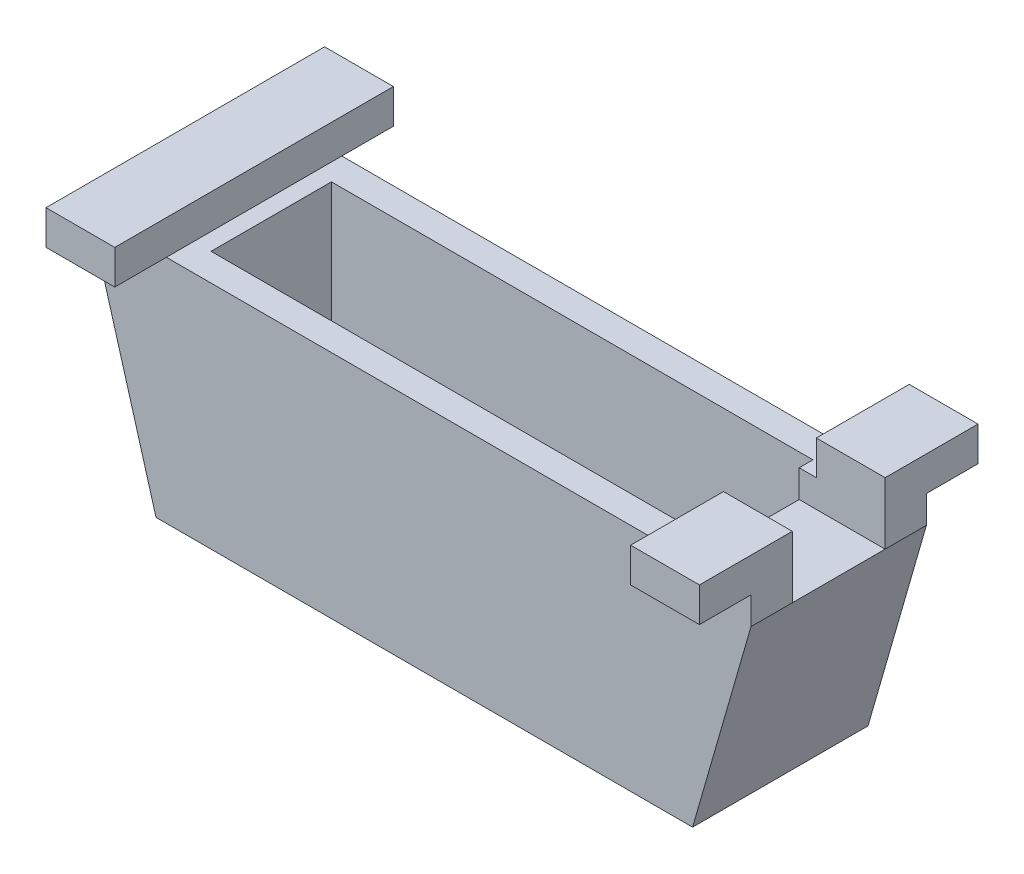
ISO-10303-21;
HEADER;
FILE_DESCRIPTION(('STEP AP214'),'2;1');
FILE_NAME('part.step','',(''),(''),'','','');
FILE_SCHEMA(('AUTOMOTIVE_DESIGN { 1 0 10303 214 1 1 1 1 }'));
ENDSEC;
DATA;
#1=APPLICATION_CONTEXT('core data for automotive mechanical design processes');
#2=APPLICATION_PROTOCOL_DEFINITION('international standard','automotive_design',2000,#1);
#3=PRODUCT_CONTEXT('',#1,'mechanical');
#4=PRODUCT('Part','Part','',(#3));
#5=PRODUCT_RELATED_PRODUCT_CATEGORY('part','',(#4));
#6=PRODUCT_DEFINITION_FORMATION('','',#4);
#7=PRODUCT_DEFINITION_CONTEXT('part definition',#1,'design');
#8=PRODUCT_DEFINITION('design','',#6,#7);
#9=PRODUCT_DEFINITION_SHAPE('','',#8);
#10=(LENGTH_UNIT() NAMED_UNIT(*) SI_UNIT(.MILLI.,.METRE.));
#11=(NAMED_UNIT(*) PLANE_ANGLE_UNIT() SI_UNIT($,.RADIAN.));
#12=(NAMED_UNIT(*) SI_UNIT($,.STERADIAN.) SOLID_ANGLE_UNIT());
#13=UNCERTAINTY_MEASURE_WITH_UNIT(LENGTH_MEASURE(1.E-05),#10,'distance_accuracy_value','');
#14=(GEOMETRIC_REPRESENTATION_CONTEXT(3) GLOBAL_UNCERTAINTY_ASSIGNED_CONTEXT((#13)) GLOBAL_UNIT_ASSIGNED_CONTEXT((#10,
#11,#12)) REPRESENTATION_CONTEXT('',''));
#15=CARTESIAN_POINT('',(0.,0.,0.));
#16=DIRECTION('',(0.,0.,1.));
#17=DIRECTION('',(1.,0.,0.));
#18=AXIS2_PLACEMENT_3D('',#15,#16,#17);
#19=CARTESIAN_POINT('',(60.317753860768,42.545,-16.1925));
#20=DIRECTION('',(-1.,0.,0.));
#21=DIRECTION('',(0.,0.,1.));
#22=AXIS2_PLACEMENT_3D('',#19,#20,#21);
#23=PLANE('',#22);
#24=DIRECTION('',(0.,0.,-1.));
#25=VECTOR('',#24,1.);
#26=CARTESIAN_POINT('',(60.317753860768,48.895,-25.7175));
#27=LINE('',#26,#25);
#28=CARTESIAN_POINT('',(60.317753860768,48.895,-8.5725));
#29=VERTEX_POINT('',#28);
#30=CARTESIAN_POINT('',(60.317753860768,48.895,-25.7175));
#31=VERTEX_POINT('',#30);
#32=EDGE_CURVE('E299',#29,#31,#27,.T.);
#33=ORIENTED_EDGE('',*,*,#32,.F.);
#34=DIRECTION('',(0.,1.,0.));
#35=VECTOR('',#34,1.);
#36=CARTESIAN_POINT('',(60.317753860768,37.465,-8.5725));
#37=LINE('',#36,#35);
#38=CARTESIAN_POINT('',(60.317753860768,37.465,-8.5725));
#39=VERTEX_POINT('',#38);
#40=EDGE_CURVE('E231',#39,#29,#37,.T.);
#41=ORIENTED_EDGE('',*,*,#40,.F.);
#42=DIRECTION('',(0.,0.,-1.));
#43=VECTOR('',#42,1.);
#44=CARTESIAN_POINT('',(60.317753860768,37.465,-16.1925));
#45=LINE('',#44,#43);
#46=CARTESIAN_POINT('',(60.317753860768,37.465,-16.1925));
#47=VERTEX_POINT('',#46);
#48=EDGE_CURVE('E342',#39,#47,#45,.T.);
#49=ORIENTED_EDGE('',*,*,#48,.T.);
#50=DIRECTION('',(0.,-1.,0.));
#51=VECTOR('',#50,1.);
#52=CARTESIAN_POINT('',(60.317753860768,42.545,-16.1925));
#53=LINE('',#52,#51);
#54=CARTESIAN_POINT('',(60.317753860768,42.545,-16.1925));
#55=VERTEX_POINT('',#54);
#56=EDGE_CURVE('E365',#55,#47,#53,.T.);
#57=ORIENTED_EDGE('',*,*,#56,.F.);
#58=DIRECTION('',(0.,0.,-1.));
#59=VECTOR('',#58,1.);
#60=CARTESIAN_POINT('',(60.317753860768,42.545,-25.7175));
#61=LINE('',#60,#59);
#62=CARTESIAN_POINT('',(60.317753860768,42.545,-25.7175));
#63=VERTEX_POINT('',#62);
#64=EDGE_CURVE('E294',#55,#63,#61,.T.);
#65=ORIENTED_EDGE('',*,*,#64,.T.);
#66=DIRECTION('',(0.,-1.,0.));
#67=VECTOR('',#66,1.);
#68=CARTESIAN_POINT('',(60.317753860768,48.895,-25.7175));
#69=LINE('',#68,#67);
#70=EDGE_CURVE('E328',#31,#63,#69,.T.);
#71=ORIENTED_EDGE('',*,*,#70,.F.);
#72=EDGE_LOOP('',(#33,#41,#49,#57,#65,#71));
#73=FACE_BOUND('',#72,.T.);
#74=ADVANCED_FACE('F35',(#73),#23,.F.);
#75=CARTESIAN_POINT('',(47.617753860768,48.895,-25.7175));
#76=DIRECTION('',(1.,0.,0.));
#77=DIRECTION('',(0.,0.,-1.));
#78=AXIS2_PLACEMENT_3D('',#75,#76,#77);
#79=PLANE('',#78);
#80=DIRECTION('',(0.,0.,1.));
#81=VECTOR('',#80,1.);
#82=CARTESIAN_POINT('',(47.617753860768,42.545,-25.7175));
#83=LINE('',#82,#81);
#84=CARTESIAN_POINT('',(47.617753860768,42.545,-16.1925));
#85=VERTEX_POINT('',#84);
#86=CARTESIAN_POINT('',(47.617753860768,42.545,-8.57249999999999));
#87=VERTEX_POINT('',#86);
#88=EDGE_CURVE('E43',#85,#87,#83,.T.);
#89=ORIENTED_EDGE('',*,*,#88,.T.);
#90=DIRECTION('',(0.,1.,0.));
#91=VECTOR('',#90,1.);
#92=CARTESIAN_POINT('',(47.617753860768,48.895,-8.57249999999999));
#93=LINE('',#92,#91);
#94=CARTESIAN_POINT('',(47.617753860768,48.895,-8.57249999999999));
#95=VERTEX_POINT('',#94);
#96=EDGE_CURVE('E242',#87,#95,#93,.T.);
#97=ORIENTED_EDGE('',*,*,#96,.T.);
#98=DIRECTION('',(0.,0.,1.));
#99=VECTOR('',#98,1.);
#100=CARTESIAN_POINT('',(47.617753860768,48.895,-25.7175));
#101=LINE('',#100,#99);
#102=CARTESIAN_POINT('',(47.617753860768,48.895,-25.7175));
#103=VERTEX_POINT('',#102);
#104=EDGE_CURVE('E302',#103,#95,#101,.T.);
#105=ORIENTED_EDGE('',*,*,#104,.F.);
#106=DIRECTION('',(0.,-1.,0.));
#107=VECTOR('',#106,1.);
#108=CARTESIAN_POINT('',(47.617753860768,48.895,-25.7175));
#109=LINE('',#108,#107);
#110=CARTESIAN_POINT('',(47.617753860768,42.545,-25.7175));
#111=VERTEX_POINT('',#110);
#112=EDGE_CURVE('E325',#103,#111,#109,.T.);
#113=ORIENTED_EDGE('',*,*,#112,.T.);
#114=EDGE_CURVE('E314',#111,#85,#83,.T.);
#115=ORIENTED_EDGE('',*,*,#114,.T.);
#116=EDGE_LOOP('',(#89,#97,#105,#113,#115));
#117=FACE_BOUND('',#116,.T.);
#118=ADVANCED_FACE('F459',(#117),#79,.F.);
#119=CARTESIAN_POINT('',(0.,48.895,0.));
#120=DIRECTION('',(0.,-1.,0.));
#121=DIRECTION('',(0.,0.,-1.));
#122=AXIS2_PLACEMENT_3D('',#119,#120,#121);
#123=PLANE('',#122);
#124=ORIENTED_EDGE('',*,*,#104,.T.);
#125=DIRECTION('',(-1.,0.,0.));
#126=VECTOR('',#125,1.);
#127=CARTESIAN_POINT('',(44.45,48.895,-8.57249999999999));
#128=LINE('',#127,#126);
#129=EDGE_CURVE('E224',#29,#95,#128,.T.);
#130=ORIENTED_EDGE('',*,*,#129,.F.);
#131=ORIENTED_EDGE('',*,*,#32,.T.);
#132=DIRECTION('',(-1.,0.,0.));
#133=VECTOR('',#132,1.);
#134=CARTESIAN_POINT('',(60.317753860768,48.895,-25.7175));
#135=LINE('',#134,#133);
#136=EDGE_CURVE('E298',#31,#103,#135,.T.);
#137=ORIENTED_EDGE('',*,*,#136,.T.);
#138=EDGE_LOOP('',(#124,#130,#131,#137));
#139=FACE_BOUND('',#138,.T.);
#140=ADVANCED_FACE('F447',(#139),#123,.F.);
#141=CARTESIAN_POINT('',(0.,42.545,0.));
#142=DIRECTION('',(0.,1.,0.));
#143=DIRECTION('',(0.,0.,1.));
#144=AXIS2_PLACEMENT_3D('',#141,#142,#143);
#145=PLANE('',#144);
#146=DIRECTION('',(-1.,0.,0.));
#147=VECTOR('',#146,1.);
#148=CARTESIAN_POINT('',(0.,42.545,-8.57249999999997));
#149=LINE('',#148,#147);
#150=CARTESIAN_POINT('',(44.45,42.545,-8.57249999999999));
#151=VERTEX_POINT('',#150);
#152=EDGE_CURVE('E245',#87,#151,#149,.T.);
#153=ORIENTED_EDGE('',*,*,#152,.F.);
#154=ORIENTED_EDGE('',*,*,#88,.F.);
#155=DIRECTION('',(-1.,0.,0.));
#156=VECTOR('',#155,1.);
#157=CARTESIAN_POINT('',(-60.317753860768,42.545,-16.1925));
#158=LINE('',#157,#156);
#159=CARTESIAN_POINT('',(-47.617753860768,42.545,-16.1925));
#160=VERTEX_POINT('',#159);
#161=EDGE_CURVE('E347',#85,#160,#158,.T.);
#162=ORIENTED_EDGE('',*,*,#161,.T.);
#163=DIRECTION('',(0.,0.,-1.));
#164=VECTOR('',#163,1.);
#165=CARTESIAN_POINT('',(-47.617753860768,42.545,-25.7175));
#166=LINE('',#165,#164);
#167=CARTESIAN_POINT('',(-47.617753860768,42.545,16.1925));
#168=VERTEX_POINT('',#167);
#169=EDGE_CURVE('E281',#168,#160,#166,.T.);
#170=ORIENTED_EDGE('',*,*,#169,.F.);
#171=DIRECTION('',(1.,0.,0.));
#172=VECTOR('',#171,1.);
#173=CARTESIAN_POINT('',(-60.317753860768,42.545,16.1925));
#174=LINE('',#173,#172);
#175=CARTESIAN_POINT('',(47.617753860768,42.545,16.1925));
#176=VERTEX_POINT('',#175);
#177=EDGE_CURVE('E352',#168,#176,#174,.T.);
#178=ORIENTED_EDGE('',*,*,#177,.T.);
#179=CARTESIAN_POINT('',(47.617753860768,42.545,8.5725));
#180=VERTEX_POINT('',#179);
#181=EDGE_CURVE('E318',#180,#176,#83,.T.);
#182=ORIENTED_EDGE('',*,*,#181,.F.);
#183=DIRECTION('',(1.,0.,0.));
#184=VECTOR('',#183,1.);
#185=CARTESIAN_POINT('',(0.,42.545,8.5725));
#186=LINE('',#185,#184);
#187=CARTESIAN_POINT('',(44.45,42.545,8.5725));
#188=VERTEX_POINT('',#187);
#189=EDGE_CURVE('E239',#188,#180,#186,.T.);
#190=ORIENTED_EDGE('',*,*,#189,.F.);
#191=DIRECTION('',(0.,0.,-1.));
#192=VECTOR('',#191,1.);
#193=CARTESIAN_POINT('',(44.45,42.545,-11.1125));
#194=LINE('',#193,#192);
#195=CARTESIAN_POINT('',(44.45,42.545,11.1125));
#196=VERTEX_POINT('',#195);
#197=EDGE_CURVE('E229',#196,#188,#194,.T.);
#198=ORIENTED_EDGE('',*,*,#197,.F.);
#199=DIRECTION('',(1.,0.,0.));
#200=VECTOR('',#199,1.);
#201=CARTESIAN_POINT('',(-44.45,42.545,11.1125));
#202=LINE('',#201,#200);
#203=CARTESIAN_POINT('',(-44.45,42.545,11.1125));
#204=VERTEX_POINT('',#203);
#205=EDGE_CURVE('E339',#204,#196,#202,.T.);
#206=ORIENTED_EDGE('',*,*,#205,.F.);
#207=DIRECTION('',(0.,0.,1.));
#208=VECTOR('',#207,1.);
#209=CARTESIAN_POINT('',(-44.45,42.545,-11.1125));
#210=LINE('',#209,#208);
#211=CARTESIAN_POINT('',(-44.45,42.545,-11.1125));
#212=VERTEX_POINT('',#211);
#213=EDGE_CURVE('E336',#212,#204,#210,.T.);
#214=ORIENTED_EDGE('',*,*,#213,.F.);
#215=DIRECTION('',(-1.,0.,0.));
#216=VECTOR('',#215,1.);
#217=CARTESIAN_POINT('',(-44.45,42.545,-11.1125));
#218=LINE('',#217,#216);
#219=CARTESIAN_POINT('',(44.45,42.545,-11.1125));
#220=VERTEX_POINT('',#219);
#221=EDGE_CURVE('E333',#220,#212,#218,.T.);
#222=ORIENTED_EDGE('',*,*,#221,.F.);
#223=EDGE_CURVE('E331',#151,#220,#194,.T.);
#224=ORIENTED_EDGE('',*,*,#223,.F.);
#225=EDGE_LOOP('',(#153,#154,#162,#170,#178,#182,#190,#198,#206,#214,#222,#224));
#226=FACE_BOUND('',#225,.T.);
#227=ADVANCED_FACE('F424',(#226),#145,.T.);
#228=CARTESIAN_POINT('',(0.,2.54,0.));
#229=DIRECTION('',(0.,-1.,0.));
#230=DIRECTION('',(0.,0.,-1.));
#231=AXIS2_PLACEMENT_3D('',#228,#229,#230);
#232=PLANE('',#231);
#233=DIRECTION('',(0.,0.,-1.));
#234=VECTOR('',#233,1.);
#235=CARTESIAN_POINT('',(44.45,2.54,11.1125));
#236=LINE('',#235,#234);
#237=CARTESIAN_POINT('',(44.45,2.54,11.1125));
#238=VERTEX_POINT('',#237);
#239=CARTESIAN_POINT('',(44.45,2.54,-11.1125));
#240=VERTEX_POINT('',#239);
#241=EDGE_CURVE('E388',#238,#240,#236,.T.);
#242=ORIENTED_EDGE('',*,*,#241,.T.);
#243=DIRECTION('',(-1.,0.,0.));
#244=VECTOR('',#243,1.);
#245=CARTESIAN_POINT('',(-44.45,2.54,-11.1125));
#246=LINE('',#245,#244);
#247=CARTESIAN_POINT('',(-44.45,2.54,-11.1125));
#248=VERTEX_POINT('',#247);
#249=EDGE_CURVE('E391',#240,#248,#246,.T.);
#250=ORIENTED_EDGE('',*,*,#249,.T.);
#251=DIRECTION('',(0.,0.,1.));
#252=VECTOR('',#251,1.);
#253=CARTESIAN_POINT('',(-44.45,2.54,11.1125));
#254=LINE('',#253,#252);
#255=CARTESIAN_POINT('',(-44.45,2.54,11.1125));
#256=VERTEX_POINT('',#255);
#257=EDGE_CURVE('E394',#248,#256,#254,.T.);
#258=ORIENTED_EDGE('',*,*,#257,.T.);
#259=DIRECTION('',(1.,0.,0.));
#260=VECTOR('',#259,1.);
#261=CARTESIAN_POINT('',(-44.45,2.54,11.1125));
#262=LINE('',#261,#260);
#263=EDGE_CURVE('E396',#256,#238,#262,.T.);
#264=ORIENTED_EDGE('',*,*,#263,.T.);
#265=EDGE_LOOP('',(#242,#250,#258,#264));
#266=FACE_BOUND('',#265,.T.);
#267=ADVANCED_FACE('F468',(#266),#232,.F.);
#268=CARTESIAN_POINT('',(-44.45,-104.219344773415,11.1125));
#269=DIRECTION('',(-1.,0.,0.));
#270=DIRECTION('',(0.,0.,1.));
#271=AXIS2_PLACEMENT_3D('',#268,#269,#270);
#272=PLANE('',#271);
#273=DIRECTION('',(0.,1.,0.));
#274=VECTOR('',#273,1.);
#275=CARTESIAN_POINT('',(-44.45,-104.219344773415,11.1125));
#276=LINE('',#275,#274);
#277=EDGE_CURVE('E386',#256,#204,#276,.T.);
#278=ORIENTED_EDGE('',*,*,#277,.F.);
#279=ORIENTED_EDGE('',*,*,#257,.F.);
#280=DIRECTION('',(0.,1.,0.));
#281=VECTOR('',#280,1.);
#282=CARTESIAN_POINT('',(-44.45,-104.219344773415,-11.1125));
#283=LINE('',#282,#281);
#284=EDGE_CURVE('E372',#248,#212,#283,.T.);
#285=ORIENTED_EDGE('',*,*,#284,.T.);
#286=ORIENTED_EDGE('',*,*,#213,.T.);
#287=EDGE_LOOP('',(#278,#279,#285,#286));
#288=FACE_BOUND('',#287,.T.);
#289=ADVANCED_FACE('F474',(#288),#272,.F.);
#290=CARTESIAN_POINT('',(44.45,-104.219344773415,-11.1125));
#291=DIRECTION('',(0.,0.,-1.));
#292=DIRECTION('',(-1.,0.,0.));
#293=AXIS2_PLACEMENT_3D('',#290,#291,#292);
#294=PLANE('',#293);
#295=ORIENTED_EDGE('',*,*,#284,.F.);
#296=ORIENTED_EDGE('',*,*,#249,.F.);
#297=DIRECTION('',(0.,1.,0.));
#298=VECTOR('',#297,1.);
#299=CARTESIAN_POINT('',(44.45,-104.219344773415,-11.1125));
#300=LINE('',#299,#298);
#301=EDGE_CURVE('E381',#240,#220,#300,.T.);
#302=ORIENTED_EDGE('',*,*,#301,.T.);
#303=ORIENTED_EDGE('',*,*,#221,.T.);
#304=EDGE_LOOP('',(#295,#296,#302,#303));
#305=FACE_BOUND('',#304,.T.);
#306=ADVANCED_FACE('F467',(#305),#294,.F.);
#307=CARTESIAN_POINT('',(44.45,-104.219344773415,11.1125));
#308=DIRECTION('',(1.,0.,0.));
#309=DIRECTION('',(0.,0.,-1.));
#310=AXIS2_PLACEMENT_3D('',#307,#308,#309);
#311=PLANE('',#310);
#312=DIRECTION('',(0.,0.,1.));
#313=VECTOR('',#312,1.);
#314=CARTESIAN_POINT('',(44.45,37.465,8.5725));
#315=LINE('',#314,#313);
#316=CARTESIAN_POINT('',(44.45,37.465,-8.57249999999999));
#317=VERTEX_POINT('',#316);
#318=CARTESIAN_POINT('',(44.45,37.465,8.5725));
#319=VERTEX_POINT('',#318);
#320=EDGE_CURVE('E215',#317,#319,#315,.T.);
#321=ORIENTED_EDGE('',*,*,#320,.F.);
#322=DIRECTION('',(0.,1.,0.));
#323=VECTOR('',#322,1.);
#324=CARTESIAN_POINT('',(44.45,37.465,-8.57249999999999));
#325=LINE('',#324,#323);
#326=EDGE_CURVE('E240',#317,#151,#325,.T.);
#327=ORIENTED_EDGE('',*,*,#326,.T.);
#328=ORIENTED_EDGE('',*,*,#223,.T.);
#329=ORIENTED_EDGE('',*,*,#301,.F.);
#330=ORIENTED_EDGE('',*,*,#241,.F.);
#331=DIRECTION('',(0.,1.,0.));
#332=VECTOR('',#331,1.);
#333=CARTESIAN_POINT('',(44.45,-104.219344773415,11.1125));
#334=LINE('',#333,#332);
#335=EDGE_CURVE('E384',#238,#196,#334,.T.);
#336=ORIENTED_EDGE('',*,*,#335,.T.);
#337=ORIENTED_EDGE('',*,*,#197,.T.);
#338=DIRECTION('',(0.,1.,0.));
#339=VECTOR('',#338,1.);
#340=CARTESIAN_POINT('',(44.45,37.465,8.5725));
#341=LINE('',#340,#339);
#342=EDGE_CURVE('E209',#319,#188,#341,.T.);
#343=ORIENTED_EDGE('',*,*,#342,.F.);
#344=EDGE_LOOP('',(#321,#327,#328,#329,#330,#336,#337,#343));
#345=FACE_BOUND('',#344,.T.);
#346=ADVANCED_FACE('F227',(#345),#311,.F.);
#347=CARTESIAN_POINT('',(44.45,-104.219344773415,11.1125));
#348=DIRECTION('',(0.,0.,1.));
#349=DIRECTION('',(1.,0.,0.));
#350=AXIS2_PLACEMENT_3D('',#347,#348,#349);
#351=PLANE('',#350);
#352=ORIENTED_EDGE('',*,*,#335,.F.);
#353=ORIENTED_EDGE('',*,*,#263,.F.);
#354=ORIENTED_EDGE('',*,*,#277,.T.);
#355=ORIENTED_EDGE('',*,*,#205,.T.);
#356=EDGE_LOOP('',(#352,#353,#354,#355));
#357=FACE_BOUND('',#356,.T.);
#358=ADVANCED_FACE('F471',(#357),#351,.F.);
#359=CARTESIAN_POINT('',(60.317753860768,37.465,16.1925));
#360=VERTEX_POINT('',#359);
#361=CARTESIAN_POINT('',(60.317753860768,37.465,8.5725));
#362=VERTEX_POINT('',#361);
#363=EDGE_CURVE('E353',#360,#362,#45,.T.);
#364=ORIENTED_EDGE('',*,*,#363,.T.);
#365=DIRECTION('',(0.,1.,0.));
#366=VECTOR('',#365,1.);
#367=CARTESIAN_POINT('',(60.317753860768,37.465,8.5725));
#368=LINE('',#367,#366);
#369=CARTESIAN_POINT('',(60.317753860768,48.895,8.5725));
#370=VERTEX_POINT('',#369);
#371=EDGE_CURVE('E212',#362,#370,#368,.T.);
#372=ORIENTED_EDGE('',*,*,#371,.T.);
#373=CARTESIAN_POINT('',(60.317753860768,48.895,25.7175));
#374=VERTEX_POINT('',#373);
#375=EDGE_CURVE('E295',#374,#370,#27,.T.);
#376=ORIENTED_EDGE('',*,*,#375,.F.);
#377=DIRECTION('',(0.,-1.,0.));
#378=VECTOR('',#377,1.);
#379=CARTESIAN_POINT('',(60.317753860768,48.895,25.7175));
#380=LINE('',#379,#378);
#381=CARTESIAN_POINT('',(60.317753860768,42.545,25.7175));
#382=VERTEX_POINT('',#381);
#383=EDGE_CURVE('E307',#374,#382,#380,.T.);
#384=ORIENTED_EDGE('',*,*,#383,.T.);
#385=CARTESIAN_POINT('',(60.317753860768,42.545,16.1925));
#386=VERTEX_POINT('',#385);
#387=EDGE_CURVE('E308',#382,#386,#61,.T.);
#388=ORIENTED_EDGE('',*,*,#387,.T.);
#389=DIRECTION('',(0.,-1.,0.));
#390=VECTOR('',#389,1.);
#391=CARTESIAN_POINT('',(60.317753860768,42.545,16.1925));
#392=LINE('',#391,#390);
#393=EDGE_CURVE('E351',#386,#360,#392,.T.);
#394=ORIENTED_EDGE('',*,*,#393,.T.);
#395=EDGE_LOOP('',(#364,#372,#376,#384,#388,#394));
#396=FACE_BOUND('',#395,.T.);
#397=ADVANCED_FACE('F418',(#396),#23,.F.);
#398=CARTESIAN_POINT('',(-60.317753860768,42.545,-16.1925));
#399=DIRECTION('',(1.,0.,0.));
#400=DIRECTION('',(0.,0.,-1.));
#401=AXIS2_PLACEMENT_3D('',#398,#399,#400);
#402=PLANE('',#401);
#403=DIRECTION('',(0.,0.,1.));
#404=VECTOR('',#403,1.);
#405=CARTESIAN_POINT('',(-60.317753860768,37.465,-16.1925));
#406=LINE('',#405,#404);
#407=CARTESIAN_POINT('',(-60.317753860768,37.465,-16.1925));
#408=VERTEX_POINT('',#407);
#409=CARTESIAN_POINT('',(-60.317753860768,37.465,16.1925));
#410=VERTEX_POINT('',#409);
#411=EDGE_CURVE('E356',#408,#410,#406,.T.);
#412=ORIENTED_EDGE('',*,*,#411,.T.);
#413=DIRECTION('',(0.,-1.,0.));
#414=VECTOR('',#413,1.);
#415=CARTESIAN_POINT('',(-60.317753860768,42.545,16.1925));
#416=LINE('',#415,#414);
#417=CARTESIAN_POINT('',(-60.317753860768,42.545,16.1925));
#418=VERTEX_POINT('',#417);
#419=EDGE_CURVE('E360',#418,#410,#416,.T.);
#420=ORIENTED_EDGE('',*,*,#419,.F.);
#421=DIRECTION('',(0.,0.,1.));
#422=VECTOR('',#421,1.);
#423=CARTESIAN_POINT('',(-60.317753860768,42.545,-25.7175));
#424=LINE('',#423,#422);
#425=CARTESIAN_POINT('',(-60.317753860768,42.545,25.7175));
#426=VERTEX_POINT('',#425);
#427=EDGE_CURVE('E272',#418,#426,#424,.T.);
#428=ORIENTED_EDGE('',*,*,#427,.T.);
#429=DIRECTION('',(0.,-1.,0.));
#430=VECTOR('',#429,1.);
#431=CARTESIAN_POINT('',(-60.317753860768,48.895,25.7175));
#432=LINE('',#431,#430);
#433=CARTESIAN_POINT('',(-60.317753860768,48.895,25.7175));
#434=VERTEX_POINT('',#433);
#435=EDGE_CURVE('E287',#434,#426,#432,.T.);
#436=ORIENTED_EDGE('',*,*,#435,.F.);
#437=DIRECTION('',(0.,0.,1.));
#438=VECTOR('',#437,1.);
#439=CARTESIAN_POINT('',(-60.317753860768,48.895,-25.7175));
#440=LINE('',#439,#438);
#441=CARTESIAN_POINT('',(-60.317753860768,48.895,-25.7175));
#442=VERTEX_POINT('',#441);
#443=EDGE_CURVE('E262',#442,#434,#440,.T.);
#444=ORIENTED_EDGE('',*,*,#443,.F.);
#445=DIRECTION('',(0.,-1.,0.));
#446=VECTOR('',#445,1.);
#447=CARTESIAN_POINT('',(-60.317753860768,48.895,-25.7175));
#448=LINE('',#447,#446);
#449=CARTESIAN_POINT('',(-60.317753860768,42.545,-25.7175));
#450=VERTEX_POINT('',#449);
#451=EDGE_CURVE('E290',#442,#450,#448,.T.);
#452=ORIENTED_EDGE('',*,*,#451,.T.);
#453=CARTESIAN_POINT('',(-60.317753860768,42.545,-16.1925));
#454=VERTEX_POINT('',#453);
#455=EDGE_CURVE('E273',#450,#454,#424,.T.);
#456=ORIENTED_EDGE('',*,*,#455,.T.);
#457=DIRECTION('',(0.,-1.,0.));
#458=VECTOR('',#457,1.);
#459=CARTESIAN_POINT('',(-60.317753860768,42.545,-16.1925));
#460=LINE('',#459,#458);
#461=EDGE_CURVE('E363',#454,#408,#460,.T.);
#462=ORIENTED_EDGE('',*,*,#461,.T.);
#463=EDGE_LOOP('',(#412,#420,#428,#436,#444,#452,#456,#462));
#464=FACE_BOUND('',#463,.T.);
#465=ADVANCED_FACE('F491',(#464),#402,.F.);
#466=CARTESIAN_POINT('',(0.,0.,0.));
#467=DIRECTION('',(0.,-1.,0.));
#468=DIRECTION('',(0.,0.,-1.));
#469=AXIS2_PLACEMENT_3D('',#466,#467,#468);
#470=PLANE('',#469);
#471=DIRECTION('',(0.,0.,1.));
#472=VECTOR('',#471,1.);
#473=CARTESIAN_POINT('',(-49.53,0.,16.1925));
#474=LINE('',#473,#472);
#475=CARTESIAN_POINT('',(-49.53,0.,-16.1925));
#476=VERTEX_POINT('',#475);
#477=CARTESIAN_POINT('',(-49.53,0.,16.1925));
#478=VERTEX_POINT('',#477);
#479=EDGE_CURVE('E368',#476,#478,#474,.T.);
#480=ORIENTED_EDGE('',*,*,#479,.F.);
#481=DIRECTION('',(-1.,0.,0.));
#482=VECTOR('',#481,1.);
#483=CARTESIAN_POINT('',(49.53,0.,-16.1925));
#484=LINE('',#483,#482);
#485=CARTESIAN_POINT('',(49.53,0.,-16.1925));
#486=VERTEX_POINT('',#485);
#487=EDGE_CURVE('E376',#486,#476,#484,.T.);
#488=ORIENTED_EDGE('',*,*,#487,.F.);
#489=DIRECTION('',(0.,0.,-1.));
#490=VECTOR('',#489,1.);
#491=CARTESIAN_POINT('',(49.53,0.,16.1925));
#492=LINE('',#491,#490);
#493=CARTESIAN_POINT('',(49.53,0.,16.1925));
#494=VERTEX_POINT('',#493);
#495=EDGE_CURVE('E373',#494,#486,#492,.T.);
#496=ORIENTED_EDGE('',*,*,#495,.F.);
#497=DIRECTION('',(1.,0.,0.));
#498=VECTOR('',#497,1.);
#499=CARTESIAN_POINT('',(49.53,0.,16.1925));
#500=LINE('',#499,#498);
#501=EDGE_CURVE('E369',#478,#494,#500,.T.);
#502=ORIENTED_EDGE('',*,*,#501,.F.);
#503=EDGE_LOOP('',(#480,#488,#496,#502));
#504=FACE_BOUND('',#503,.T.);
#505=ADVANCED_FACE('F37',(#504),#470,.T.);
#506=CARTESIAN_POINT('',(49.53,-104.219344773415,-16.1925));
#507=DIRECTION('',(0.,0.,-1.));
#508=DIRECTION('',(-1.,0.,0.));
#509=AXIS2_PLACEMENT_3D('',#506,#507,#508);
#510=PLANE('',#509);
#511=DIRECTION('',(-0.276699879071916,0.960956386586606,0.));
#512=VECTOR('',#511,1.);
#513=CARTESIAN_POINT('',(-60.317753860768,37.465,-16.1925));
#514=LINE('',#513,#512);
#515=EDGE_CURVE('E247',#476,#408,#514,.T.);
#516=ORIENTED_EDGE('',*,*,#515,.T.);
#517=ORIENTED_EDGE('',*,*,#461,.F.);
#518=DIRECTION('',(-1.,0.,0.));
#519=VECTOR('',#518,1.);
#520=CARTESIAN_POINT('',(49.53,42.545,-16.1925));
#521=LINE('',#520,#519);
#522=EDGE_CURVE('E58',#160,#454,#521,.T.);
#523=ORIENTED_EDGE('',*,*,#522,.F.);
#524=ORIENTED_EDGE('',*,*,#161,.F.);
#525=EDGE_CURVE('E343',#55,#85,#158,.T.);
#526=ORIENTED_EDGE('',*,*,#525,.F.);
#527=ORIENTED_EDGE('',*,*,#56,.T.);
#528=DIRECTION('',(-0.276699879071916,-0.960956386586606,0.));
#529=VECTOR('',#528,1.);
#530=CARTESIAN_POINT('',(49.53,0.,-16.1925));
#531=LINE('',#530,#529);
#532=EDGE_CURVE('E253',#47,#486,#531,.T.);
#533=ORIENTED_EDGE('',*,*,#532,.T.);
#534=ORIENTED_EDGE('',*,*,#487,.T.);
#535=EDGE_LOOP('',(#516,#517,#523,#524,#526,#527,#533,#534));
#536=FACE_BOUND('',#535,.T.);
#537=ADVANCED_FACE('F503',(#536),#510,.T.);
#538=CARTESIAN_POINT('',(49.53,-104.219344773415,16.1925));
#539=DIRECTION('',(0.,0.,1.));
#540=DIRECTION('',(1.,0.,0.));
#541=AXIS2_PLACEMENT_3D('',#538,#539,#540);
#542=PLANE('',#541);
#543=DIRECTION('',(-0.276699879071916,-0.960956386586606,0.));
#544=VECTOR('',#543,1.);
#545=CARTESIAN_POINT('',(49.53,0.,16.1925));
#546=LINE('',#545,#544);
#547=EDGE_CURVE('E256',#360,#494,#546,.T.);
#548=ORIENTED_EDGE('',*,*,#547,.F.);
#549=ORIENTED_EDGE('',*,*,#393,.F.);
#550=EDGE_CURVE('E346',#176,#386,#174,.T.);
#551=ORIENTED_EDGE('',*,*,#550,.F.);
#552=ORIENTED_EDGE('',*,*,#177,.F.);
#553=EDGE_CURVE('E348',#418,#168,#174,.T.);
#554=ORIENTED_EDGE('',*,*,#553,.F.);
#555=ORIENTED_EDGE('',*,*,#419,.T.);
#556=DIRECTION('',(-0.276699879071916,0.960956386586606,0.));
#557=VECTOR('',#556,1.);
#558=CARTESIAN_POINT('',(-60.317753860768,37.465,16.1925));
#559=LINE('',#558,#557);
#560=EDGE_CURVE('E250',#478,#410,#559,.T.);
#561=ORIENTED_EDGE('',*,*,#560,.F.);
#562=ORIENTED_EDGE('',*,*,#501,.T.);
#563=EDGE_LOOP('',(#548,#549,#551,#552,#554,#555,#561,#562));
#564=FACE_BOUND('',#563,.T.);
#565=ADVANCED_FACE('F429',(#564),#542,.T.);
#566=CARTESIAN_POINT('',(0.,42.545,0.));
#567=DIRECTION('',(0.,-1.,0.));
#568=DIRECTION('',(0.,0.,-1.));
#569=AXIS2_PLACEMENT_3D('',#566,#567,#568);
#570=PLANE('',#569);
#571=ORIENTED_EDGE('',*,*,#64,.F.);
#572=ORIENTED_EDGE('',*,*,#525,.T.);
#573=ORIENTED_EDGE('',*,*,#114,.F.);
#574=DIRECTION('',(-1.,0.,0.));
#575=VECTOR('',#574,1.);
#576=CARTESIAN_POINT('',(60.317753860768,42.545,-25.7175));
#577=LINE('',#576,#575);
#578=EDGE_CURVE('E311',#63,#111,#577,.T.);
#579=ORIENTED_EDGE('',*,*,#578,.F.);
#580=EDGE_LOOP('',(#571,#572,#573,#579));
#581=FACE_BOUND('',#580,.T.);
#582=ADVANCED_FACE('F506',(#581),#570,.T.);
#583=CARTESIAN_POINT('',(60.317753860768,48.895,-25.7175));
#584=DIRECTION('',(0.,0.,1.));
#585=DIRECTION('',(1.,0.,0.));
#586=AXIS2_PLACEMENT_3D('',#583,#584,#585);
#587=PLANE('',#586);
#588=ORIENTED_EDGE('',*,*,#578,.T.);
#589=ORIENTED_EDGE('',*,*,#112,.F.);
#590=ORIENTED_EDGE('',*,*,#136,.F.);
#591=ORIENTED_EDGE('',*,*,#70,.T.);
#592=EDGE_LOOP('',(#588,#589,#590,#591));
#593=FACE_BOUND('',#592,.T.);
#594=ADVANCED_FACE('F455',(#593),#587,.F.);
#595=CARTESIAN_POINT('',(47.617753860768,48.895,8.5725));
#596=VERTEX_POINT('',#595);
#597=CARTESIAN_POINT('',(47.617753860768,48.895,25.7175));
#598=VERTEX_POINT('',#597);
#599=EDGE_CURVE('E301',#596,#598,#101,.T.);
#600=ORIENTED_EDGE('',*,*,#599,.F.);
#601=DIRECTION('',(0.,-1.,0.));
#602=VECTOR('',#601,1.);
#603=CARTESIAN_POINT('',(47.617753860768,48.895,8.5725));
#604=LINE('',#603,#602);
#605=EDGE_CURVE('E236',#596,#180,#604,.T.);
#606=ORIENTED_EDGE('',*,*,#605,.T.);
#607=ORIENTED_EDGE('',*,*,#181,.T.);
#608=CARTESIAN_POINT('',(47.617753860768,42.545,25.7175));
#609=VERTEX_POINT('',#608);
#610=EDGE_CURVE('E313',#176,#609,#83,.T.);
#611=ORIENTED_EDGE('',*,*,#610,.T.);
#612=DIRECTION('',(0.,-1.,0.));
#613=VECTOR('',#612,1.);
#614=CARTESIAN_POINT('',(47.617753860768,48.895,25.7175));
#615=LINE('',#614,#613);
#616=EDGE_CURVE('E322',#598,#609,#615,.T.);
#617=ORIENTED_EDGE('',*,*,#616,.F.);
#618=EDGE_LOOP('',(#600,#606,#607,#611,#617));
#619=FACE_BOUND('',#618,.T.);
#620=ADVANCED_FACE('F406',(#619),#79,.F.);
#621=CARTESIAN_POINT('',(60.317753860768,48.895,25.7175));
#622=DIRECTION('',(0.,0.,-1.));
#623=DIRECTION('',(-1.,0.,0.));
#624=AXIS2_PLACEMENT_3D('',#621,#622,#623);
#625=PLANE('',#624);
#626=DIRECTION('',(1.,0.,0.));
#627=VECTOR('',#626,1.);
#628=CARTESIAN_POINT('',(60.317753860768,42.545,25.7175));
#629=LINE('',#628,#627);
#630=EDGE_CURVE('E317',#609,#382,#629,.T.);
#631=ORIENTED_EDGE('',*,*,#630,.T.);
#632=ORIENTED_EDGE('',*,*,#383,.F.);
#633=DIRECTION('',(1.,0.,0.));
#634=VECTOR('',#633,1.);
#635=CARTESIAN_POINT('',(60.317753860768,48.895,25.7175));
#636=LINE('',#635,#634);
#637=EDGE_CURVE('E305',#598,#374,#636,.T.);
#638=ORIENTED_EDGE('',*,*,#637,.F.);
#639=ORIENTED_EDGE('',*,*,#616,.T.);
#640=EDGE_LOOP('',(#631,#632,#638,#639));
#641=FACE_BOUND('',#640,.T.);
#642=ADVANCED_FACE('F412',(#641),#625,.F.);
#643=ORIENTED_EDGE('',*,*,#375,.T.);
#644=DIRECTION('',(-1.,0.,0.));
#645=VECTOR('',#644,1.);
#646=CARTESIAN_POINT('',(0.,48.895,8.5725));
#647=LINE('',#646,#645);
#648=EDGE_CURVE('E11',#370,#596,#647,.T.);
#649=ORIENTED_EDGE('',*,*,#648,.T.);
#650=ORIENTED_EDGE('',*,*,#599,.T.);
#651=ORIENTED_EDGE('',*,*,#637,.T.);
#652=EDGE_LOOP('',(#643,#649,#650,#651));
#653=FACE_BOUND('',#652,.T.);
#654=ADVANCED_FACE('F421',(#653),#123,.F.);
#655=ORIENTED_EDGE('',*,*,#610,.F.);
#656=ORIENTED_EDGE('',*,*,#550,.T.);
#657=ORIENTED_EDGE('',*,*,#387,.F.);
#658=ORIENTED_EDGE('',*,*,#630,.F.);
#659=EDGE_LOOP('',(#655,#656,#657,#658));
#660=FACE_BOUND('',#659,.T.);
#661=ADVANCED_FACE('F415',(#660),#570,.T.);
#662=CARTESIAN_POINT('',(0.,42.545,0.));
#663=DIRECTION('',(0.,-1.,0.));
#664=DIRECTION('',(0.,0.,-1.));
#665=AXIS2_PLACEMENT_3D('',#662,#663,#664);
#666=PLANE('',#665);
#667=CARTESIAN_POINT('',(-47.617753860768,42.545,-25.7175));
#668=VERTEX_POINT('',#667);
#669=EDGE_CURVE('E278',#160,#668,#166,.T.);
#670=ORIENTED_EDGE('',*,*,#669,.F.);
#671=ORIENTED_EDGE('',*,*,#522,.T.);
#672=ORIENTED_EDGE('',*,*,#455,.F.);
#673=DIRECTION('',(-1.,0.,0.));
#674=VECTOR('',#673,1.);
#675=CARTESIAN_POINT('',(-60.317753860768,42.545,-25.7175));
#676=LINE('',#675,#674);
#677=EDGE_CURVE('E258',#668,#450,#676,.T.);
#678=ORIENTED_EDGE('',*,*,#677,.F.);
#679=EDGE_LOOP('',(#670,#671,#672,#678));
#680=FACE_BOUND('',#679,.T.);
#681=ADVANCED_FACE('F519',(#680),#666,.T.);
#682=CARTESIAN_POINT('',(-60.317753860768,48.895,-25.7175));
#683=DIRECTION('',(0.,0.,1.));
#684=DIRECTION('',(1.,0.,0.));
#685=AXIS2_PLACEMENT_3D('',#682,#683,#684);
#686=PLANE('',#685);
#687=ORIENTED_EDGE('',*,*,#677,.T.);
#688=ORIENTED_EDGE('',*,*,#451,.F.);
#689=DIRECTION('',(-1.,0.,0.));
#690=VECTOR('',#689,1.);
#691=CARTESIAN_POINT('',(-60.317753860768,48.895,-25.7175));
#692=LINE('',#691,#690);
#693=CARTESIAN_POINT('',(-47.617753860768,48.895,-25.7175));
#694=VERTEX_POINT('',#693);
#695=EDGE_CURVE('E259',#694,#442,#692,.T.);
#696=ORIENTED_EDGE('',*,*,#695,.F.);
#697=DIRECTION('',(0.,-1.,0.));
#698=VECTOR('',#697,1.);
#699=CARTESIAN_POINT('',(-47.617753860768,48.895,-25.7175));
#700=LINE('',#699,#698);
#701=EDGE_CURVE('E269',#694,#668,#700,.T.);
#702=ORIENTED_EDGE('',*,*,#701,.T.);
#703=EDGE_LOOP('',(#687,#688,#696,#702));
#704=FACE_BOUND('',#703,.T.);
#705=ADVANCED_FACE('F524',(#704),#686,.F.);
#706=CARTESIAN_POINT('',(-60.317753860768,48.895,25.7175));
#707=DIRECTION('',(0.,0.,-1.));
#708=DIRECTION('',(-1.,0.,0.));
#709=AXIS2_PLACEMENT_3D('',#706,#707,#708);
#710=PLANE('',#709);
#711=DIRECTION('',(1.,0.,0.));
#712=VECTOR('',#711,1.);
#713=CARTESIAN_POINT('',(-60.317753860768,42.545,25.7175));
#714=LINE('',#713,#712);
#715=CARTESIAN_POINT('',(-47.617753860768,42.545,25.7175));
#716=VERTEX_POINT('',#715);
#717=EDGE_CURVE('E276',#426,#716,#714,.T.);
#718=ORIENTED_EDGE('',*,*,#717,.T.);
#719=DIRECTION('',(0.,-1.,0.));
#720=VECTOR('',#719,1.);
#721=CARTESIAN_POINT('',(-47.617753860768,48.895,25.7175));
#722=LINE('',#721,#720);
#723=CARTESIAN_POINT('',(-47.617753860768,48.895,25.7175));
#724=VERTEX_POINT('',#723);
#725=EDGE_CURVE('E284',#724,#716,#722,.T.);
#726=ORIENTED_EDGE('',*,*,#725,.F.);
#727=DIRECTION('',(1.,0.,0.));
#728=VECTOR('',#727,1.);
#729=CARTESIAN_POINT('',(-60.317753860768,48.895,25.7175));
#730=LINE('',#729,#728);
#731=EDGE_CURVE('E265',#434,#724,#730,.T.);
#732=ORIENTED_EDGE('',*,*,#731,.F.);
#733=ORIENTED_EDGE('',*,*,#435,.T.);
#734=EDGE_LOOP('',(#718,#726,#732,#733));
#735=FACE_BOUND('',#734,.T.);
#736=ADVANCED_FACE('F570',(#735),#710,.F.);
#737=CARTESIAN_POINT('',(-47.617753860768,48.895,-25.7175));
#738=DIRECTION('',(-1.,0.,0.));
#739=DIRECTION('',(0.,0.,1.));
#740=AXIS2_PLACEMENT_3D('',#737,#738,#739);
#741=PLANE('',#740);
#742=EDGE_CURVE('E263',#716,#168,#166,.T.);
#743=ORIENTED_EDGE('',*,*,#742,.T.);
#744=ORIENTED_EDGE('',*,*,#169,.T.);
#745=ORIENTED_EDGE('',*,*,#669,.T.);
#746=ORIENTED_EDGE('',*,*,#701,.F.);
#747=DIRECTION('',(0.,0.,-1.));
#748=VECTOR('',#747,1.);
#749=CARTESIAN_POINT('',(-47.617753860768,48.895,-25.7175));
#750=LINE('',#749,#748);
#751=EDGE_CURVE('E267',#724,#694,#750,.T.);
#752=ORIENTED_EDGE('',*,*,#751,.F.);
#753=ORIENTED_EDGE('',*,*,#725,.T.);
#754=EDGE_LOOP('',(#743,#744,#745,#746,#752,#753));
#755=FACE_BOUND('',#754,.T.);
#756=ADVANCED_FACE('F579',(#755),#741,.F.);
#757=CARTESIAN_POINT('',(0.,48.895,0.));
#758=DIRECTION('',(0.,-1.,0.));
#759=DIRECTION('',(0.,0.,-1.));
#760=AXIS2_PLACEMENT_3D('',#757,#758,#759);
#761=PLANE('',#760);
#762=ORIENTED_EDGE('',*,*,#695,.T.);
#763=ORIENTED_EDGE('',*,*,#443,.T.);
#764=ORIENTED_EDGE('',*,*,#731,.T.);
#765=ORIENTED_EDGE('',*,*,#751,.T.);
#766=EDGE_LOOP('',(#762,#763,#764,#765));
#767=FACE_BOUND('',#766,.T.);
#768=ADVANCED_FACE('F589',(#767),#761,.F.);
#769=ORIENTED_EDGE('',*,*,#427,.F.);
#770=ORIENTED_EDGE('',*,*,#553,.T.);
#771=ORIENTED_EDGE('',*,*,#742,.F.);
#772=ORIENTED_EDGE('',*,*,#717,.F.);
#773=EDGE_LOOP('',(#769,#770,#771,#772));
#774=FACE_BOUND('',#773,.T.);
#775=ADVANCED_FACE('F527',(#774),#666,.T.);
#776=CARTESIAN_POINT('',(49.53,0.,55.1797012121993));
#777=DIRECTION('',(0.960956386586606,-0.276699879071916,0.));
#778=DIRECTION('',(0.276699879071916,0.960956386586606,0.));
#779=AXIS2_PLACEMENT_3D('',#776,#777,#778);
#780=PLANE('',#779);
#781=ORIENTED_EDGE('',*,*,#363,.F.);
#782=ORIENTED_EDGE('',*,*,#547,.T.);
#783=ORIENTED_EDGE('',*,*,#495,.T.);
#784=ORIENTED_EDGE('',*,*,#532,.F.);
#785=ORIENTED_EDGE('',*,*,#48,.F.);
#786=DIRECTION('',(0.,0.,-1.));
#787=VECTOR('',#786,1.);
#788=CARTESIAN_POINT('',(60.317753860768,37.465,8.5725));
#789=LINE('',#788,#787);
#790=EDGE_CURVE('E214',#362,#39,#789,.T.);
#791=ORIENTED_EDGE('',*,*,#790,.F.);
#792=EDGE_LOOP('',(#781,#782,#783,#784,#785,#791));
#793=FACE_BOUND('',#792,.T.);
#794=ADVANCED_FACE('F434',(#793),#780,.T.);
#795=CARTESIAN_POINT('',(-60.317753860768,37.465,55.1797012121993));
#796=DIRECTION('',(-0.960956386586606,-0.276699879071916,0.));
#797=DIRECTION('',(0.276699879071916,-0.960956386586606,0.));
#798=AXIS2_PLACEMENT_3D('',#795,#796,#797);
#799=PLANE('',#798);
#800=ORIENTED_EDGE('',*,*,#479,.T.);
#801=ORIENTED_EDGE('',*,*,#560,.T.);
#802=ORIENTED_EDGE('',*,*,#411,.F.);
#803=ORIENTED_EDGE('',*,*,#515,.F.);
#804=EDGE_LOOP('',(#800,#801,#802,#803));
#805=FACE_BOUND('',#804,.T.);
#806=ADVANCED_FACE('F646',(#805),#799,.T.);
#807=CARTESIAN_POINT('',(44.45,37.465,-8.57249999999999));
#808=DIRECTION('',(0.,0.,-1.));
#809=DIRECTION('',(-1.,0.,0.));
#810=AXIS2_PLACEMENT_3D('',#807,#808,#809);
#811=PLANE('',#810);
#812=ORIENTED_EDGE('',*,*,#152,.T.);
#813=ORIENTED_EDGE('',*,*,#326,.F.);
#814=DIRECTION('',(-1.,0.,0.));
#815=VECTOR('',#814,1.);
#816=CARTESIAN_POINT('',(44.45,37.465,-8.57249999999999));
#817=LINE('',#816,#815);
#818=EDGE_CURVE('E221',#39,#317,#817,.T.);
#819=ORIENTED_EDGE('',*,*,#818,.F.);
#820=ORIENTED_EDGE('',*,*,#40,.T.);
#821=ORIENTED_EDGE('',*,*,#129,.T.);
#822=ORIENTED_EDGE('',*,*,#96,.F.);
#823=EDGE_LOOP('',(#812,#813,#819,#820,#821,#822));
#824=FACE_BOUND('',#823,.T.);
#825=ADVANCED_FACE('F443',(#824),#811,.F.);
#826=CARTESIAN_POINT('',(44.45,37.465,8.5725));
#827=DIRECTION('',(0.,0.,1.));
#828=DIRECTION('',(1.,0.,0.));
#829=AXIS2_PLACEMENT_3D('',#826,#827,#828);
#830=PLANE('',#829);
#831=ORIENTED_EDGE('',*,*,#189,.T.);
#832=ORIENTED_EDGE('',*,*,#605,.F.);
#833=ORIENTED_EDGE('',*,*,#648,.F.);
#834=ORIENTED_EDGE('',*,*,#371,.F.);
#835=DIRECTION('',(1.,0.,0.));
#836=VECTOR('',#835,1.);
#837=CARTESIAN_POINT('',(44.45,37.465,8.5725));
#838=LINE('',#837,#836);
#839=EDGE_CURVE('E50',#319,#362,#838,.T.);
#840=ORIENTED_EDGE('',*,*,#839,.F.);
#841=ORIENTED_EDGE('',*,*,#342,.T.);
#842=EDGE_LOOP('',(#831,#832,#833,#834,#840,#841));
#843=FACE_BOUND('',#842,.T.);
#844=ADVANCED_FACE('F207',(#843),#830,.F.);
#845=CARTESIAN_POINT('',(0.,37.465,0.));
#846=DIRECTION('',(0.,-1.,0.));
#847=DIRECTION('',(0.,0.,-1.));
#848=AXIS2_PLACEMENT_3D('',#845,#846,#847);
#849=PLANE('',#848);
#850=ORIENTED_EDGE('',*,*,#320,.T.);
#851=ORIENTED_EDGE('',*,*,#839,.T.);
#852=ORIENTED_EDGE('',*,*,#790,.T.);
#853=ORIENTED_EDGE('',*,*,#818,.T.);
#854=EDGE_LOOP('',(#850,#851,#852,#853));
#855=FACE_BOUND('',#854,.T.);
#856=ADVANCED_FACE('F219',(#855),#849,.F.);
#857=CLOSED_SHELL('',(#74,#118,#140,#227,#267,#289,#306,#346,#358,#397,#465,#505,#537,#565,#582,
#594,#620,#642,#654,#661,#681,#705,#736,#756,#768,#775,#794,#806,#825,#844,#856));
#858=MANIFOLD_SOLID_BREP('B2',#857);
#859=ADVANCED_BREP_SHAPE_REPRESENTATION('',(#18,#858),#14);
#860=SHAPE_DEFINITION_REPRESENTATION(#9,#859);
ENDSEC;
END-ISO-10303-21;
